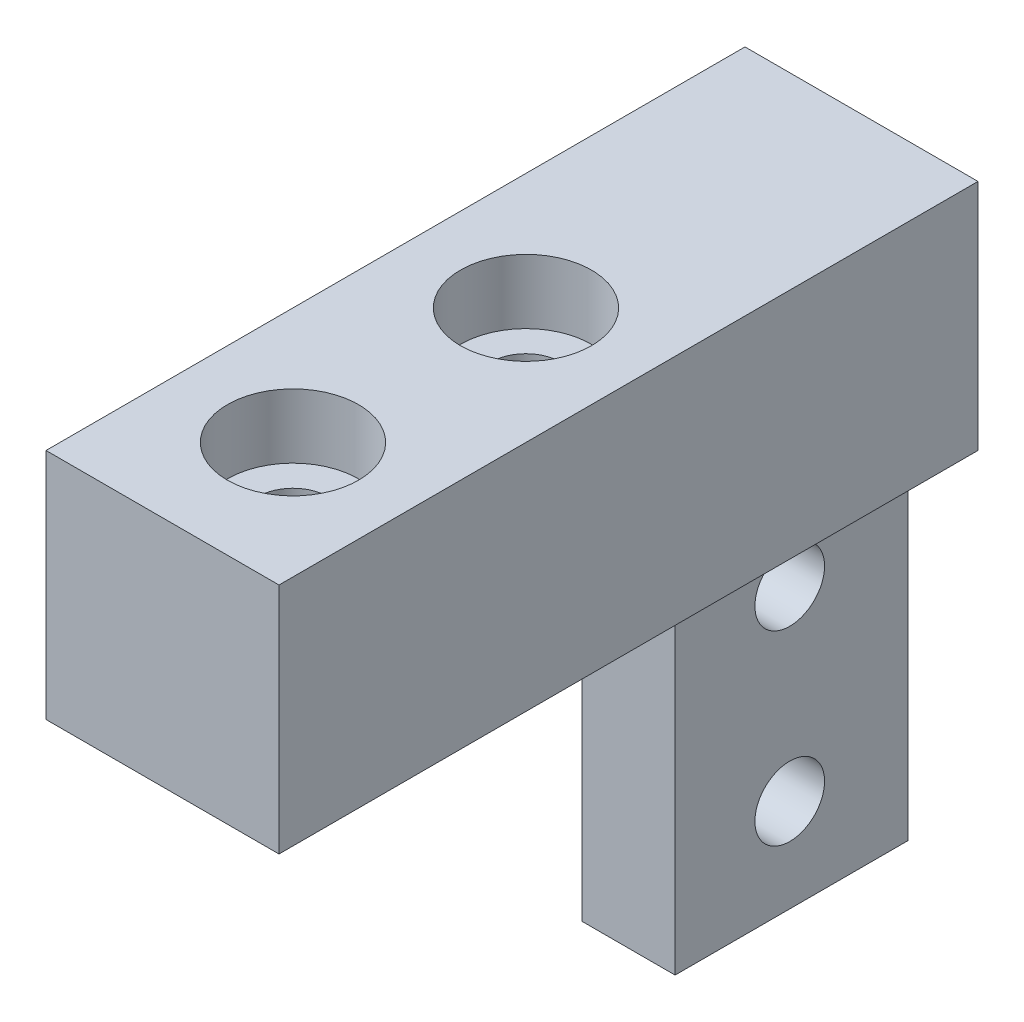
ISO-10303-21;
HEADER;
FILE_DESCRIPTION(('STEP AP214'),'2;1');
FILE_NAME('part.step','',(''),(''),'','','');
FILE_SCHEMA(('AUTOMOTIVE_DESIGN { 1 0 10303 214 1 1 1 1 }'));
ENDSEC;
DATA;
#1=APPLICATION_CONTEXT('core data for automotive mechanical design processes');
#2=APPLICATION_PROTOCOL_DEFINITION('international standard','automotive_design',2000,#1);
#3=PRODUCT_CONTEXT('',#1,'mechanical');
#4=PRODUCT('Part','Part','',(#3));
#5=PRODUCT_RELATED_PRODUCT_CATEGORY('part','',(#4));
#6=PRODUCT_DEFINITION_FORMATION('','',#4);
#7=PRODUCT_DEFINITION_CONTEXT('part definition',#1,'design');
#8=PRODUCT_DEFINITION('design','',#6,#7);
#9=PRODUCT_DEFINITION_SHAPE('','',#8);
#10=(LENGTH_UNIT() NAMED_UNIT(*) SI_UNIT(.MILLI.,.METRE.));
#11=(NAMED_UNIT(*) PLANE_ANGLE_UNIT() SI_UNIT($,.RADIAN.));
#12=(NAMED_UNIT(*) SI_UNIT($,.STERADIAN.) SOLID_ANGLE_UNIT());
#13=UNCERTAINTY_MEASURE_WITH_UNIT(LENGTH_MEASURE(1.E-05),#10,'distance_accuracy_value','');
#14=(GEOMETRIC_REPRESENTATION_CONTEXT(3) GLOBAL_UNCERTAINTY_ASSIGNED_CONTEXT((#13)) GLOBAL_UNIT_ASSIGNED_CONTEXT((#10,
#11,#12)) REPRESENTATION_CONTEXT('',''));
#15=CARTESIAN_POINT('',(0.,0.,0.));
#16=DIRECTION('',(0.,0.,1.));
#17=DIRECTION('',(1.,0.,0.));
#18=AXIS2_PLACEMENT_3D('',#15,#16,#17);
#19=CARTESIAN_POINT('',(12.7,-12.7,0.));
#20=DIRECTION('',(0.,1.,0.));
#21=DIRECTION('',(0.,0.,1.));
#22=AXIS2_PLACEMENT_3D('',#19,#20,#21);
#23=PLANE('',#22);
#24=CARTESIAN_POINT('',(6.35,-12.7,-7.112));
#25=DIRECTION('',(0.,1.,0.));
#26=DIRECTION('',(0.,0.,1.));
#27=AXIS2_PLACEMENT_3D('',#24,#25,#26);
#28=CIRCLE('',#27,1.89864999999999);
#29=CARTESIAN_POINT('',(6.35,-12.7,-5.21335000000001));
#30=VERTEX_POINT('',#29);
#31=EDGE_CURVE('E37',#30,#30,#28,.T.);
#32=ORIENTED_EDGE('',*,*,#31,.T.);
#33=EDGE_LOOP('',(#32));
#34=FACE_BOUND('',#33,.T.);
#35=CARTESIAN_POINT('',(6.35,-12.7,-19.812));
#36=DIRECTION('',(0.,1.,0.));
#37=DIRECTION('',(0.,0.,1.));
#38=AXIS2_PLACEMENT_3D('',#35,#36,#37);
#39=CIRCLE('',#38,1.89864999999999);
#40=CARTESIAN_POINT('',(6.35,-12.7,-17.91335));
#41=VERTEX_POINT('',#40);
#42=EDGE_CURVE('E148',#41,#41,#39,.T.);
#43=ORIENTED_EDGE('',*,*,#42,.T.);
#44=EDGE_LOOP('',(#43));
#45=FACE_BOUND('',#44,.T.);
#46=DIRECTION('',(-1.,0.,0.));
#47=VECTOR('',#46,1.);
#48=CARTESIAN_POINT('',(12.7,-12.7,-25.4));
#49=LINE('',#48,#47);
#50=CARTESIAN_POINT('',(8.89,-12.7,-25.4));
#51=VERTEX_POINT('',#50);
#52=CARTESIAN_POINT('',(3.81,-12.7,-25.4));
#53=VERTEX_POINT('',#52);
#54=EDGE_CURVE('E106',#51,#53,#49,.T.);
#55=ORIENTED_EDGE('',*,*,#54,.F.);
#56=DIRECTION('',(0.,0.,-1.));
#57=VECTOR('',#56,1.);
#58=CARTESIAN_POINT('',(8.89,-12.7,-25.4));
#59=LINE('',#58,#57);
#60=CARTESIAN_POINT('',(8.89,-12.7,-38.1));
#61=VERTEX_POINT('',#60);
#62=EDGE_CURVE('E98',#51,#61,#59,.T.);
#63=ORIENTED_EDGE('',*,*,#62,.T.);
#64=DIRECTION('',(1.,0.,0.));
#65=VECTOR('',#64,1.);
#66=CARTESIAN_POINT('',(12.7,-12.7,-38.1));
#67=LINE('',#66,#65);
#68=CARTESIAN_POINT('',(12.7,-12.7,-38.1));
#69=VERTEX_POINT('',#68);
#70=EDGE_CURVE('E116',#61,#69,#67,.T.);
#71=ORIENTED_EDGE('',*,*,#70,.T.);
#72=DIRECTION('',(0.,0.,-1.));
#73=VECTOR('',#72,1.);
#74=CARTESIAN_POINT('',(12.7,-12.7,0.));
#75=LINE('',#74,#73);
#76=CARTESIAN_POINT('',(12.7,-12.7,0.));
#77=VERTEX_POINT('',#76);
#78=EDGE_CURVE('E129',#77,#69,#75,.T.);
#79=ORIENTED_EDGE('',*,*,#78,.F.);
#80=DIRECTION('',(-1.,0.,0.));
#81=VECTOR('',#80,1.);
#82=CARTESIAN_POINT('',(12.7,-12.7,0.));
#83=LINE('',#82,#81);
#84=CARTESIAN_POINT('',(0.,-12.7,0.));
#85=VERTEX_POINT('',#84);
#86=EDGE_CURVE('E11',#77,#85,#83,.T.);
#87=ORIENTED_EDGE('',*,*,#86,.T.);
#88=DIRECTION('',(0.,0.,-1.));
#89=VECTOR('',#88,1.);
#90=CARTESIAN_POINT('',(0.,-12.7,0.));
#91=LINE('',#90,#89);
#92=CARTESIAN_POINT('',(0.,-12.7,-38.1));
#93=VERTEX_POINT('',#92);
#94=EDGE_CURVE('E140',#85,#93,#91,.T.);
#95=ORIENTED_EDGE('',*,*,#94,.T.);
#96=DIRECTION('',(1.,0.,0.));
#97=VECTOR('',#96,1.);
#98=CARTESIAN_POINT('',(3.81,-12.7,-38.1));
#99=LINE('',#98,#97);
#100=CARTESIAN_POINT('',(3.81,-12.7,-38.1));
#101=VERTEX_POINT('',#100);
#102=EDGE_CURVE('E174',#93,#101,#99,.T.);
#103=ORIENTED_EDGE('',*,*,#102,.T.);
#104=DIRECTION('',(0.,0.,-1.));
#105=VECTOR('',#104,1.);
#106=CARTESIAN_POINT('',(3.81,-12.7,-25.4));
#107=LINE('',#106,#105);
#108=EDGE_CURVE('E119',#53,#101,#107,.T.);
#109=ORIENTED_EDGE('',*,*,#108,.F.);
#110=EDGE_LOOP('',(#55,#63,#71,#79,#87,#95,#103,#109));
#111=FACE_BOUND('',#110,.T.);
#112=ADVANCED_FACE('F33',(#34,#45,#111),#23,.F.);
#113=CARTESIAN_POINT('',(12.7,0.,0.));
#114=DIRECTION('',(0.,0.,-1.));
#115=DIRECTION('',(0.,1.,0.));
#116=AXIS2_PLACEMENT_3D('',#113,#114,#115);
#117=PLANE('',#116);
#118=DIRECTION('',(0.,-1.,0.));
#119=VECTOR('',#118,1.);
#120=CARTESIAN_POINT('',(0.,0.,0.));
#121=LINE('',#120,#119);
#122=CARTESIAN_POINT('',(0.,0.,0.));
#123=VERTEX_POINT('',#122);
#124=EDGE_CURVE('E137',#123,#85,#121,.T.);
#125=ORIENTED_EDGE('',*,*,#124,.T.);
#126=ORIENTED_EDGE('',*,*,#86,.F.);
#127=DIRECTION('',(0.,-1.,0.));
#128=VECTOR('',#127,1.);
#129=CARTESIAN_POINT('',(12.7,0.,0.));
#130=LINE('',#129,#128);
#131=CARTESIAN_POINT('',(12.7,0.,0.));
#132=VERTEX_POINT('',#131);
#133=EDGE_CURVE('E126',#132,#77,#130,.T.);
#134=ORIENTED_EDGE('',*,*,#133,.F.);
#135=DIRECTION('',(-1.,0.,0.));
#136=VECTOR('',#135,1.);
#137=CARTESIAN_POINT('',(12.7,0.,0.));
#138=LINE('',#137,#136);
#139=EDGE_CURVE('E136',#132,#123,#138,.T.);
#140=ORIENTED_EDGE('',*,*,#139,.T.);
#141=EDGE_LOOP('',(#125,#126,#134,#140));
#142=FACE_BOUND('',#141,.T.);
#143=ADVANCED_FACE('F35',(#142),#117,.F.);
#144=CARTESIAN_POINT('',(12.7,0.,-38.1));
#145=DIRECTION('',(0.,0.,1.));
#146=DIRECTION('',(1.,0.,0.));
#147=AXIS2_PLACEMENT_3D('',#144,#145,#146);
#148=PLANE('',#147);
#149=DIRECTION('',(0.,1.,0.));
#150=VECTOR('',#149,1.);
#151=CARTESIAN_POINT('',(12.7,0.,-38.1));
#152=LINE('',#151,#150);
#153=CARTESIAN_POINT('',(12.7,0.,-38.1));
#154=VERTEX_POINT('',#153);
#155=EDGE_CURVE('E132',#69,#154,#152,.T.);
#156=ORIENTED_EDGE('',*,*,#155,.F.);
#157=ORIENTED_EDGE('',*,*,#70,.F.);
#158=DIRECTION('',(0.,1.,0.));
#159=VECTOR('',#158,1.);
#160=CARTESIAN_POINT('',(8.89,-12.7,-38.1));
#161=LINE('',#160,#159);
#162=CARTESIAN_POINT('',(8.89,-33.02,-38.1));
#163=VERTEX_POINT('',#162);
#164=EDGE_CURVE('E101',#163,#61,#161,.T.);
#165=ORIENTED_EDGE('',*,*,#164,.F.);
#166=DIRECTION('',(1.,0.,0.));
#167=VECTOR('',#166,1.);
#168=CARTESIAN_POINT('',(12.7,-33.02,-38.1));
#169=LINE('',#168,#167);
#170=CARTESIAN_POINT('',(3.81,-33.02,-38.1));
#171=VERTEX_POINT('',#170);
#172=EDGE_CURVE('E122',#171,#163,#169,.T.);
#173=ORIENTED_EDGE('',*,*,#172,.F.);
#174=DIRECTION('',(0.,-1.,0.));
#175=VECTOR('',#174,1.);
#176=CARTESIAN_POINT('',(3.81,-12.7,-38.1));
#177=LINE('',#176,#175);
#178=EDGE_CURVE('E50',#101,#171,#177,.T.);
#179=ORIENTED_EDGE('',*,*,#178,.F.);
#180=ORIENTED_EDGE('',*,*,#102,.F.);
#181=DIRECTION('',(0.,1.,0.));
#182=VECTOR('',#181,1.);
#183=CARTESIAN_POINT('',(0.,0.,-38.1));
#184=LINE('',#183,#182);
#185=CARTESIAN_POINT('',(0.,0.,-38.1));
#186=VERTEX_POINT('',#185);
#187=EDGE_CURVE('E142',#93,#186,#184,.T.);
#188=ORIENTED_EDGE('',*,*,#187,.T.);
#189=DIRECTION('',(-1.,0.,0.));
#190=VECTOR('',#189,1.);
#191=CARTESIAN_POINT('',(12.7,0.,-38.1));
#192=LINE('',#191,#190);
#193=EDGE_CURVE('E42',#154,#186,#192,.T.);
#194=ORIENTED_EDGE('',*,*,#193,.F.);
#195=EDGE_LOOP('',(#156,#157,#165,#173,#179,#180,#188,#194));
#196=FACE_BOUND('',#195,.T.);
#197=ADVANCED_FACE('F191',(#196),#148,.F.);
#198=CARTESIAN_POINT('',(12.7,0.,0.));
#199=DIRECTION('',(0.,-1.,0.));
#200=DIRECTION('',(0.,0.,-1.));
#201=AXIS2_PLACEMENT_3D('',#198,#199,#200);
#202=PLANE('',#201);
#203=CARTESIAN_POINT('',(6.35,0.,-7.112));
#204=DIRECTION('',(0.,1.,0.));
#205=DIRECTION('',(0.,0.,1.));
#206=AXIS2_PLACEMENT_3D('',#203,#204,#205);
#207=CIRCLE('',#206,3.57250999999999);
#208=CARTESIAN_POINT('',(6.35,0.,-3.53949000000001));
#209=VERTEX_POINT('',#208);
#210=EDGE_CURVE('E365',#209,#209,#207,.T.);
#211=ORIENTED_EDGE('',*,*,#210,.F.);
#212=EDGE_LOOP('',(#211));
#213=FACE_BOUND('',#212,.T.);
#214=CARTESIAN_POINT('',(6.35,0.,-19.812));
#215=DIRECTION('',(0.,1.,0.));
#216=DIRECTION('',(0.,0.,1.));
#217=AXIS2_PLACEMENT_3D('',#214,#215,#216);
#218=CIRCLE('',#217,3.57250999999999);
#219=CARTESIAN_POINT('',(6.35,0.,-16.23949));
#220=VERTEX_POINT('',#219);
#221=EDGE_CURVE('E163',#220,#220,#218,.T.);
#222=ORIENTED_EDGE('',*,*,#221,.F.);
#223=EDGE_LOOP('',(#222));
#224=FACE_BOUND('',#223,.T.);
#225=DIRECTION('',(0.,0.,1.));
#226=VECTOR('',#225,1.);
#227=CARTESIAN_POINT('',(0.,0.,0.));
#228=LINE('',#227,#226);
#229=EDGE_CURVE('E130',#186,#123,#228,.T.);
#230=ORIENTED_EDGE('',*,*,#229,.T.);
#231=ORIENTED_EDGE('',*,*,#139,.F.);
#232=DIRECTION('',(0.,0.,1.));
#233=VECTOR('',#232,1.);
#234=CARTESIAN_POINT('',(12.7,0.,0.));
#235=LINE('',#234,#233);
#236=EDGE_CURVE('E134',#154,#132,#235,.T.);
#237=ORIENTED_EDGE('',*,*,#236,.F.);
#238=ORIENTED_EDGE('',*,*,#193,.T.);
#239=EDGE_LOOP('',(#230,#231,#237,#238));
#240=FACE_BOUND('',#239,.T.);
#241=ADVANCED_FACE('F215',(#213,#224,#240),#202,.F.);
#242=CARTESIAN_POINT('',(12.7,0.,0.));
#243=DIRECTION('',(1.,0.,0.));
#244=DIRECTION('',(0.,0.,-1.));
#245=AXIS2_PLACEMENT_3D('',#242,#243,#244);
#246=PLANE('',#245);
#247=ORIENTED_EDGE('',*,*,#78,.T.);
#248=ORIENTED_EDGE('',*,*,#155,.T.);
#249=ORIENTED_EDGE('',*,*,#236,.T.);
#250=ORIENTED_EDGE('',*,*,#133,.T.);
#251=EDGE_LOOP('',(#247,#248,#249,#250));
#252=FACE_BOUND('',#251,.T.);
#253=ADVANCED_FACE('F218',(#252),#246,.T.);
#254=CARTESIAN_POINT('',(0.,0.,0.));
#255=DIRECTION('',(1.,0.,0.));
#256=DIRECTION('',(0.,0.,-1.));
#257=AXIS2_PLACEMENT_3D('',#254,#255,#256);
#258=PLANE('',#257);
#259=ORIENTED_EDGE('',*,*,#187,.F.);
#260=ORIENTED_EDGE('',*,*,#94,.F.);
#261=ORIENTED_EDGE('',*,*,#124,.F.);
#262=ORIENTED_EDGE('',*,*,#229,.F.);
#263=EDGE_LOOP('',(#259,#260,#261,#262));
#264=FACE_BOUND('',#263,.T.);
#265=ADVANCED_FACE('F203',(#264),#258,.F.);
#266=CARTESIAN_POINT('',(12.7,-33.02,-25.4));
#267=DIRECTION('',(0.,0.,-1.));
#268=DIRECTION('',(-1.,0.,0.));
#269=AXIS2_PLACEMENT_3D('',#266,#267,#268);
#270=PLANE('',#269);
#271=DIRECTION('',(-1.,0.,0.));
#272=VECTOR('',#271,1.);
#273=CARTESIAN_POINT('',(12.7,-33.02,-25.4));
#274=LINE('',#273,#272);
#275=CARTESIAN_POINT('',(8.89,-33.02,-25.4));
#276=VERTEX_POINT('',#275);
#277=CARTESIAN_POINT('',(3.81,-33.02,-25.4));
#278=VERTEX_POINT('',#277);
#279=EDGE_CURVE('E115',#276,#278,#274,.T.);
#280=ORIENTED_EDGE('',*,*,#279,.F.);
#281=DIRECTION('',(0.,1.,0.));
#282=VECTOR('',#281,1.);
#283=CARTESIAN_POINT('',(8.89,-12.7,-25.4));
#284=LINE('',#283,#282);
#285=EDGE_CURVE('E58',#276,#51,#284,.T.);
#286=ORIENTED_EDGE('',*,*,#285,.T.);
#287=ORIENTED_EDGE('',*,*,#54,.T.);
#288=DIRECTION('',(0.,-1.,0.));
#289=VECTOR('',#288,1.);
#290=CARTESIAN_POINT('',(3.81,-12.7,-25.4));
#291=LINE('',#290,#289);
#292=EDGE_CURVE('E180',#53,#278,#291,.T.);
#293=ORIENTED_EDGE('',*,*,#292,.T.);
#294=EDGE_LOOP('',(#280,#286,#287,#293));
#295=FACE_BOUND('',#294,.T.);
#296=ADVANCED_FACE('F112',(#295),#270,.F.);
#297=CARTESIAN_POINT('',(0.,-33.02,0.));
#298=DIRECTION('',(0.,-1.,0.));
#299=DIRECTION('',(0.,0.,-1.));
#300=AXIS2_PLACEMENT_3D('',#297,#298,#299);
#301=PLANE('',#300);
#302=DIRECTION('',(0.,0.,-1.));
#303=VECTOR('',#302,1.);
#304=CARTESIAN_POINT('',(8.89,-33.02,-25.4));
#305=LINE('',#304,#303);
#306=EDGE_CURVE('E107',#276,#163,#305,.T.);
#307=ORIENTED_EDGE('',*,*,#306,.F.);
#308=ORIENTED_EDGE('',*,*,#279,.T.);
#309=DIRECTION('',(0.,0.,-1.));
#310=VECTOR('',#309,1.);
#311=CARTESIAN_POINT('',(3.81,-33.02,-25.4));
#312=LINE('',#311,#310);
#313=EDGE_CURVE('E177',#278,#171,#312,.T.);
#314=ORIENTED_EDGE('',*,*,#313,.T.);
#315=ORIENTED_EDGE('',*,*,#172,.T.);
#316=EDGE_LOOP('',(#307,#308,#314,#315));
#317=FACE_BOUND('',#316,.T.);
#318=ADVANCED_FACE('F194',(#317),#301,.T.);
#319=CARTESIAN_POINT('',(3.81,-12.7,-25.4));
#320=DIRECTION('',(1.,0.,0.));
#321=DIRECTION('',(0.,1.,0.));
#322=AXIS2_PLACEMENT_3D('',#319,#320,#321);
#323=PLANE('',#322);
#324=CARTESIAN_POINT('',(3.81,-17.78,-31.6479776421659));
#325=DIRECTION('',(1.,0.,0.));
#326=DIRECTION('',(0.,1.,0.));
#327=AXIS2_PLACEMENT_3D('',#324,#325,#326);
#328=CIRCLE('',#327,1.89865);
#329=CARTESIAN_POINT('',(3.81,-15.88135,-31.6479776421659));
#330=VERTEX_POINT('',#329);
#331=EDGE_CURVE('E155',#330,#330,#328,.T.);
#332=ORIENTED_EDGE('',*,*,#331,.T.);
#333=EDGE_LOOP('',(#332));
#334=FACE_BOUND('',#333,.T.);
#335=CARTESIAN_POINT('',(3.81,-27.94,-31.6479776421659));
#336=DIRECTION('',(1.,0.,0.));
#337=DIRECTION('',(0.,1.,0.));
#338=AXIS2_PLACEMENT_3D('',#335,#336,#337);
#339=CIRCLE('',#338,1.89865);
#340=CARTESIAN_POINT('',(3.81,-26.04135,-31.6479776421659));
#341=VERTEX_POINT('',#340);
#342=EDGE_CURVE('E172',#341,#341,#339,.T.);
#343=ORIENTED_EDGE('',*,*,#342,.T.);
#344=EDGE_LOOP('',(#343));
#345=FACE_BOUND('',#344,.T.);
#346=ORIENTED_EDGE('',*,*,#178,.T.);
#347=ORIENTED_EDGE('',*,*,#313,.F.);
#348=ORIENTED_EDGE('',*,*,#292,.F.);
#349=ORIENTED_EDGE('',*,*,#108,.T.);
#350=EDGE_LOOP('',(#346,#347,#348,#349));
#351=FACE_BOUND('',#350,.T.);
#352=ADVANCED_FACE('F185',(#334,#345,#351),#323,.F.);
#353=CARTESIAN_POINT('',(8.89,-12.7,-25.4));
#354=DIRECTION('',(-1.,0.,0.));
#355=DIRECTION('',(0.,-1.,0.));
#356=AXIS2_PLACEMENT_3D('',#353,#354,#355);
#357=PLANE('',#356);
#358=CARTESIAN_POINT('',(8.89,-17.78,-31.6479776421659));
#359=DIRECTION('',(1.,0.,0.));
#360=DIRECTION('',(0.,0.,-1.));
#361=AXIS2_PLACEMENT_3D('',#358,#359,#360);
#362=CIRCLE('',#361,1.89865);
#363=CARTESIAN_POINT('',(8.89,-17.78,-33.5466276421659));
#364=VERTEX_POINT('',#363);
#365=EDGE_CURVE('E150',#364,#364,#362,.T.);
#366=ORIENTED_EDGE('',*,*,#365,.F.);
#367=EDGE_LOOP('',(#366));
#368=FACE_BOUND('',#367,.T.);
#369=CARTESIAN_POINT('',(8.89,-27.94,-31.6479776421659));
#370=DIRECTION('',(1.,0.,0.));
#371=DIRECTION('',(0.,0.,-1.));
#372=AXIS2_PLACEMENT_3D('',#369,#370,#371);
#373=CIRCLE('',#372,1.89865);
#374=CARTESIAN_POINT('',(8.89,-27.94,-33.5466276421659));
#375=VERTEX_POINT('',#374);
#376=EDGE_CURVE('E169',#375,#375,#373,.T.);
#377=ORIENTED_EDGE('',*,*,#376,.F.);
#378=EDGE_LOOP('',(#377));
#379=FACE_BOUND('',#378,.T.);
#380=ORIENTED_EDGE('',*,*,#164,.T.);
#381=ORIENTED_EDGE('',*,*,#62,.F.);
#382=ORIENTED_EDGE('',*,*,#285,.F.);
#383=ORIENTED_EDGE('',*,*,#306,.T.);
#384=EDGE_LOOP('',(#380,#381,#382,#383));
#385=FACE_BOUND('',#384,.T.);
#386=ADVANCED_FACE('F99',(#368,#379,#385),#357,.F.);
#387=CARTESIAN_POINT('',(8.89,-27.94,-31.6479776421659));
#388=DIRECTION('',(1.,0.,0.));
#389=DIRECTION('',(0.,0.,-1.));
#390=AXIS2_PLACEMENT_3D('',#387,#388,#389);
#391=CYLINDRICAL_SURFACE('',#390,1.89865);
#392=ORIENTED_EDGE('',*,*,#376,.T.);
#393=EDGE_LOOP('',(#392));
#394=FACE_BOUND('',#393,.T.);
#395=ORIENTED_EDGE('',*,*,#342,.F.);
#396=EDGE_LOOP('',(#395));
#397=FACE_BOUND('',#396,.T.);
#398=ADVANCED_FACE('F267',(#394,#397),#391,.F.);
#399=CARTESIAN_POINT('',(8.89,-17.78,-31.6479776421659));
#400=DIRECTION('',(1.,0.,0.));
#401=DIRECTION('',(0.,0.,-1.));
#402=AXIS2_PLACEMENT_3D('',#399,#400,#401);
#403=CYLINDRICAL_SURFACE('',#402,1.89865);
#404=ORIENTED_EDGE('',*,*,#365,.T.);
#405=EDGE_LOOP('',(#404));
#406=FACE_BOUND('',#405,.T.);
#407=ORIENTED_EDGE('',*,*,#331,.F.);
#408=EDGE_LOOP('',(#407));
#409=FACE_BOUND('',#408,.T.);
#410=ADVANCED_FACE('F277',(#406,#409),#403,.F.);
#411=CARTESIAN_POINT('',(6.35,0.,-19.812));
#412=DIRECTION('',(0.,1.,0.));
#413=DIRECTION('',(0.,0.,1.));
#414=AXIS2_PLACEMENT_3D('',#411,#412,#413);
#415=CYLINDRICAL_SURFACE('',#414,1.89864999999999);
#416=CARTESIAN_POINT('',(6.35,-3.5052,-19.812));
#417=DIRECTION('',(0.,1.,0.));
#418=DIRECTION('',(0.,0.,1.));
#419=AXIS2_PLACEMENT_3D('',#416,#417,#418);
#420=CIRCLE('',#419,1.89865);
#421=CARTESIAN_POINT('',(6.35,-3.5052,-17.91335));
#422=VERTEX_POINT('',#421);
#423=EDGE_CURVE('E151',#422,#422,#420,.T.);
#424=ORIENTED_EDGE('',*,*,#423,.T.);
#425=EDGE_LOOP('',(#424));
#426=FACE_BOUND('',#425,.T.);
#427=ORIENTED_EDGE('',*,*,#42,.F.);
#428=EDGE_LOOP('',(#427));
#429=FACE_BOUND('',#428,.T.);
#430=ADVANCED_FACE('F286',(#426,#429),#415,.F.);
#431=CARTESIAN_POINT('',(8.24865,-3.5052,-19.812));
#432=DIRECTION('',(0.,-1.,0.));
#433=DIRECTION('',(0.,0.,-1.));
#434=AXIS2_PLACEMENT_3D('',#431,#432,#433);
#435=PLANE('',#434);
#436=ORIENTED_EDGE('',*,*,#423,.F.);
#437=EDGE_LOOP('',(#436));
#438=FACE_BOUND('',#437,.T.);
#439=CARTESIAN_POINT('',(6.35,-3.5052,-19.812));
#440=DIRECTION('',(0.,1.,0.));
#441=DIRECTION('',(0.,0.,1.));
#442=AXIS2_PLACEMENT_3D('',#439,#440,#441);
#443=CIRCLE('',#442,3.57251);
#444=CARTESIAN_POINT('',(6.35,-3.5052,-16.23949));
#445=VERTEX_POINT('',#444);
#446=EDGE_CURVE('E158',#445,#445,#443,.T.);
#447=ORIENTED_EDGE('',*,*,#446,.T.);
#448=EDGE_LOOP('',(#447));
#449=FACE_BOUND('',#448,.T.);
#450=ADVANCED_FACE('F306',(#438,#449),#435,.F.);
#451=CARTESIAN_POINT('',(6.35,0.,-19.812));
#452=DIRECTION('',(0.,1.,0.));
#453=DIRECTION('',(0.,0.,1.));
#454=AXIS2_PLACEMENT_3D('',#451,#452,#453);
#455=CYLINDRICAL_SURFACE('',#454,3.57250999999999);
#456=ORIENTED_EDGE('',*,*,#446,.F.);
#457=EDGE_LOOP('',(#456));
#458=FACE_BOUND('',#457,.T.);
#459=ORIENTED_EDGE('',*,*,#221,.T.);
#460=EDGE_LOOP('',(#459));
#461=FACE_BOUND('',#460,.T.);
#462=ADVANCED_FACE('F315',(#458,#461),#455,.F.);
#463=CARTESIAN_POINT('',(6.35,0.,-7.112));
#464=DIRECTION('',(0.,1.,0.));
#465=DIRECTION('',(0.,0.,1.));
#466=AXIS2_PLACEMENT_3D('',#463,#464,#465);
#467=CYLINDRICAL_SURFACE('',#466,1.89864999999999);
#468=CARTESIAN_POINT('',(6.35,-3.5052,-7.112));
#469=DIRECTION('',(0.,1.,0.));
#470=DIRECTION('',(0.,0.,1.));
#471=AXIS2_PLACEMENT_3D('',#468,#469,#470);
#472=CIRCLE('',#471,1.89865);
#473=CARTESIAN_POINT('',(6.35,-3.5052,-5.21335));
#474=VERTEX_POINT('',#473);
#475=EDGE_CURVE('E367',#474,#474,#472,.T.);
#476=ORIENTED_EDGE('',*,*,#475,.T.);
#477=EDGE_LOOP('',(#476));
#478=FACE_BOUND('',#477,.T.);
#479=ORIENTED_EDGE('',*,*,#31,.F.);
#480=EDGE_LOOP('',(#479));
#481=FACE_BOUND('',#480,.T.);
#482=ADVANCED_FACE('F325',(#478,#481),#467,.F.);
#483=CARTESIAN_POINT('',(8.24865,-3.5052,-7.112));
#484=DIRECTION('',(0.,-1.,0.));
#485=DIRECTION('',(0.,0.,-1.));
#486=AXIS2_PLACEMENT_3D('',#483,#484,#485);
#487=PLANE('',#486);
#488=ORIENTED_EDGE('',*,*,#475,.F.);
#489=EDGE_LOOP('',(#488));
#490=FACE_BOUND('',#489,.T.);
#491=CARTESIAN_POINT('',(6.35,-3.5052,-7.112));
#492=DIRECTION('',(0.,1.,0.));
#493=DIRECTION('',(0.,0.,1.));
#494=AXIS2_PLACEMENT_3D('',#491,#492,#493);
#495=CIRCLE('',#494,3.57251);
#496=CARTESIAN_POINT('',(6.35,-3.5052,-3.53949));
#497=VERTEX_POINT('',#496);
#498=EDGE_CURVE('E362',#497,#497,#495,.T.);
#499=ORIENTED_EDGE('',*,*,#498,.T.);
#500=EDGE_LOOP('',(#499));
#501=FACE_BOUND('',#500,.T.);
#502=ADVANCED_FACE('F335',(#490,#501),#487,.F.);
#503=CARTESIAN_POINT('',(6.35,0.,-7.112));
#504=DIRECTION('',(0.,1.,0.));
#505=DIRECTION('',(0.,0.,1.));
#506=AXIS2_PLACEMENT_3D('',#503,#504,#505);
#507=CYLINDRICAL_SURFACE('',#506,3.57250999999999);
#508=ORIENTED_EDGE('',*,*,#498,.F.);
#509=EDGE_LOOP('',(#508));
#510=FACE_BOUND('',#509,.T.);
#511=ORIENTED_EDGE('',*,*,#210,.T.);
#512=EDGE_LOOP('',(#511));
#513=FACE_BOUND('',#512,.T.);
#514=ADVANCED_FACE('F345',(#510,#513),#507,.F.);
#515=CLOSED_SHELL('',(#112,#143,#197,#241,#253,#265,#296,#318,#352,#386,#398,#410,#430,#450,
#462,#482,#502,#514));
#516=MANIFOLD_SOLID_BREP('B2',#515);
#517=ADVANCED_BREP_SHAPE_REPRESENTATION('',(#18,#516),#14);
#518=SHAPE_DEFINITION_REPRESENTATION(#9,#517);
ENDSEC;
END-ISO-10303-21;
